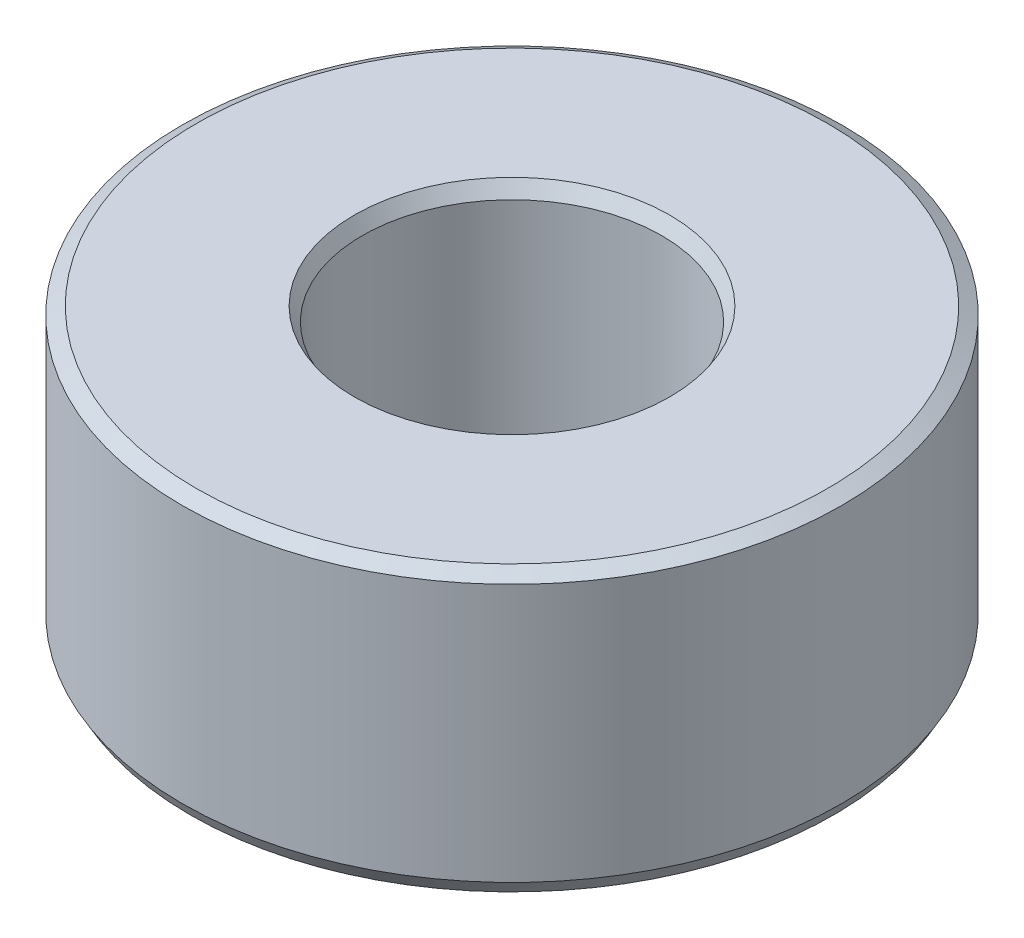
ISO-10303-21;
HEADER;
FILE_DESCRIPTION(('STEP AP214'),'2;1');
FILE_NAME('part.step','',(''),(''),'','','');
FILE_SCHEMA(('AUTOMOTIVE_DESIGN { 1 0 10303 214 1 1 1 1 }'));
ENDSEC;
DATA;
#1=APPLICATION_CONTEXT('core data for automotive mechanical design processes');
#2=APPLICATION_PROTOCOL_DEFINITION('international standard','automotive_design',2000,#1);
#3=PRODUCT_CONTEXT('',#1,'mechanical');
#4=PRODUCT('Part','Part','',(#3));
#5=PRODUCT_RELATED_PRODUCT_CATEGORY('part','',(#4));
#6=PRODUCT_DEFINITION_FORMATION('','',#4);
#7=PRODUCT_DEFINITION_CONTEXT('part definition',#1,'design');
#8=PRODUCT_DEFINITION('design','',#6,#7);
#9=PRODUCT_DEFINITION_SHAPE('','',#8);
#10=(LENGTH_UNIT() NAMED_UNIT(*) SI_UNIT(.MILLI.,.METRE.));
#11=(NAMED_UNIT(*) PLANE_ANGLE_UNIT() SI_UNIT($,.RADIAN.));
#12=(NAMED_UNIT(*) SI_UNIT($,.STERADIAN.) SOLID_ANGLE_UNIT());
#13=UNCERTAINTY_MEASURE_WITH_UNIT(LENGTH_MEASURE(1.E-05),#10,'distance_accuracy_value','');
#14=(GEOMETRIC_REPRESENTATION_CONTEXT(3) GLOBAL_UNCERTAINTY_ASSIGNED_CONTEXT((#13)) GLOBAL_UNIT_ASSIGNED_CONTEXT((#10,
#11,#12)) REPRESENTATION_CONTEXT('',''));
#15=CARTESIAN_POINT('',(0.,0.,0.));
#16=DIRECTION('',(0.,0.,1.));
#17=DIRECTION('',(1.,0.,0.));
#18=AXIS2_PLACEMENT_3D('',#15,#16,#17);
#19=CARTESIAN_POINT('',(0.,38.2073004879539,0.));
#20=DIRECTION('',(0.,-1.,0.));
#21=DIRECTION('',(0.,0.,-1.));
#22=AXIS2_PLACEMENT_3D('',#19,#20,#21);
#23=CYLINDRICAL_SURFACE('',#22,45.);
#24=CARTESIAN_POINT('',(0.,1.88488755583868,0.));
#25=DIRECTION('',(0.,1.,0.));
#26=DIRECTION('',(0.,0.,1.));
#27=AXIS2_PLACEMENT_3D('',#24,#25,#26);
#28=CIRCLE('',#27,45.);
#29=CARTESIAN_POINT('',(0.,1.88488755583868,45.));
#30=VERTEX_POINT('',#29);
#31=EDGE_CURVE('E10',#30,#30,#28,.T.);
#32=ORIENTED_EDGE('',*,*,#31,.T.);
#33=EDGE_LOOP('',(#32));
#34=FACE_BOUND('',#33,.T.);
#35=CARTESIAN_POINT('',(0.,37.1190601501982,0.));
#36=DIRECTION('',(0.,1.,0.));
#37=DIRECTION('',(0.,0.,1.));
#38=AXIS2_PLACEMENT_3D('',#35,#36,#37);
#39=CIRCLE('',#38,45.);
#40=CARTESIAN_POINT('',(0.,37.1190601501982,45.));
#41=VERTEX_POINT('',#40);
#42=EDGE_CURVE('E50',#41,#41,#39,.F.);
#43=ORIENTED_EDGE('',*,*,#42,.T.);
#44=EDGE_LOOP('',(#43));
#45=FACE_BOUND('',#44,.T.);
#46=ADVANCED_FACE('F39',(#34,#45),#23,.T.);
#47=CARTESIAN_POINT('',(0.,38.2073004879539,0.));
#48=DIRECTION('',(0.,1.,0.));
#49=DIRECTION('',(0.,0.,1.));
#50=AXIS2_PLACEMENT_3D('',#47,#48,#49);
#51=PLANE('',#50);
#52=CARTESIAN_POINT('',(0.,38.2073004879539,0.));
#53=DIRECTION('',(0.,1.,0.));
#54=DIRECTION('',(0.,0.,1.));
#55=AXIS2_PLACEMENT_3D('',#52,#53,#54);
#56=CIRCLE('',#55,21.5163535411498);
#57=CARTESIAN_POINT('',(0.,38.2073004879539,21.5163535411498));
#58=VERTEX_POINT('',#57);
#59=EDGE_CURVE('E58',#58,#58,#56,.F.);
#60=ORIENTED_EDGE('',*,*,#59,.T.);
#61=EDGE_LOOP('',(#60));
#62=FACE_BOUND('',#61,.T.);
#63=CARTESIAN_POINT('',(0.,38.2073004879539,0.));
#64=DIRECTION('',(0.,1.,0.));
#65=DIRECTION('',(0.,0.,1.));
#66=AXIS2_PLACEMENT_3D('',#63,#64,#65);
#67=CIRCLE('',#66,43.1151124441613);
#68=CARTESIAN_POINT('',(0.,38.2073004879539,43.1151124441613));
#69=VERTEX_POINT('',#68);
#70=EDGE_CURVE('E61',#69,#69,#67,.T.);
#71=ORIENTED_EDGE('',*,*,#70,.T.);
#72=EDGE_LOOP('',(#71));
#73=FACE_BOUND('',#72,.T.);
#74=ADVANCED_FACE('F88',(#62,#73),#51,.T.);
#75=CARTESIAN_POINT('',(0.,0.,0.));
#76=DIRECTION('',(0.,1.,0.));
#77=DIRECTION('',(0.,0.,1.));
#78=AXIS2_PLACEMENT_3D('',#75,#76,#77);
#79=PLANE('',#78);
#80=CARTESIAN_POINT('',(0.,0.,0.));
#81=DIRECTION('',(0.,1.,0.));
#82=DIRECTION('',(0.,0.,1.));
#83=AXIS2_PLACEMENT_3D('',#80,#81,#82);
#84=CIRCLE('',#83,22.3130007592328);
#85=CARTESIAN_POINT('',(0.,0.,22.3130007592328));
#86=VERTEX_POINT('',#85);
#87=EDGE_CURVE('E51',#86,#86,#84,.T.);
#88=ORIENTED_EDGE('',*,*,#87,.T.);
#89=EDGE_LOOP('',(#88));
#90=FACE_BOUND('',#89,.T.);
#91=CARTESIAN_POINT('',(0.,0.,0.));
#92=DIRECTION('',(0.,1.,0.));
#93=DIRECTION('',(0.,0.,1.));
#94=AXIS2_PLACEMENT_3D('',#91,#92,#93);
#95=CIRCLE('',#94,43.9117596622444);
#96=CARTESIAN_POINT('',(0.,0.,43.9117596622444));
#97=VERTEX_POINT('',#96);
#98=EDGE_CURVE('E54',#97,#97,#95,.F.);
#99=ORIENTED_EDGE('',*,*,#98,.T.);
#100=EDGE_LOOP('',(#99));
#101=FACE_BOUND('',#100,.T.);
#102=ADVANCED_FACE('F83',(#90,#101),#79,.F.);
#103=CARTESIAN_POINT('',(0.,38.2073004879539,0.));
#104=DIRECTION('',(0.,-1.,0.));
#105=DIRECTION('',(0.,0.,-1.));
#106=AXIS2_PLACEMENT_3D('',#103,#104,#105);
#107=CYLINDRICAL_SURFACE('',#106,20.4281132033941);
#108=CARTESIAN_POINT('',(0.,36.3224129321153,0.));
#109=DIRECTION('',(0.,1.,0.));
#110=DIRECTION('',(0.,0.,1.));
#111=AXIS2_PLACEMENT_3D('',#108,#109,#110);
#112=CIRCLE('',#111,20.4281132033941);
#113=CARTESIAN_POINT('',(0.,36.3224129321153,20.4281132033941));
#114=VERTEX_POINT('',#113);
#115=EDGE_CURVE('E67',#114,#114,#112,.T.);
#116=ORIENTED_EDGE('',*,*,#115,.T.);
#117=EDGE_LOOP('',(#116));
#118=FACE_BOUND('',#117,.T.);
#119=CARTESIAN_POINT('',(0.,1.08824033775565,0.));
#120=DIRECTION('',(0.,1.,0.));
#121=DIRECTION('',(0.,0.,1.));
#122=AXIS2_PLACEMENT_3D('',#119,#120,#121);
#123=CIRCLE('',#122,20.4281132033941);
#124=CARTESIAN_POINT('',(0.,1.08824033775565,20.4281132033941));
#125=VERTEX_POINT('',#124);
#126=EDGE_CURVE('E69',#125,#125,#123,.F.);
#127=ORIENTED_EDGE('',*,*,#126,.T.);
#128=EDGE_LOOP('',(#127));
#129=FACE_BOUND('',#128,.T.);
#130=ADVANCED_FACE('F71',(#118,#129),#107,.F.);
#131=CARTESIAN_POINT('',(0.,36.3224129321153,0.));
#132=DIRECTION('',(0.,1.,0.));
#133=DIRECTION('',(0.,0.,1.));
#134=AXIS2_PLACEMENT_3D('',#131,#132,#133);
#135=CONICAL_SURFACE('',#134,20.4281132033941,0.523598775598308);
#136=ORIENTED_EDGE('',*,*,#59,.F.);
#137=EDGE_LOOP('',(#136));
#138=FACE_BOUND('',#137,.T.);
#139=ORIENTED_EDGE('',*,*,#115,.F.);
#140=EDGE_LOOP('',(#139));
#141=FACE_BOUND('',#140,.T.);
#142=ADVANCED_FACE('F77',(#138,#141),#135,.F.);
#143=CARTESIAN_POINT('',(0.,0.,0.));
#144=DIRECTION('',(0.,-1.,0.));
#145=DIRECTION('',(0.,0.,-1.));
#146=AXIS2_PLACEMENT_3D('',#143,#144,#145);
#147=CONICAL_SURFACE('',#146,22.3130007592328,1.0471975511966);
#148=ORIENTED_EDGE('',*,*,#126,.F.);
#149=EDGE_LOOP('',(#148));
#150=FACE_BOUND('',#149,.T.);
#151=ORIENTED_EDGE('',*,*,#87,.F.);
#152=EDGE_LOOP('',(#151));
#153=FACE_BOUND('',#152,.T.);
#154=ADVANCED_FACE('F73',(#150,#153),#147,.F.);
#155=CARTESIAN_POINT('',(0.,1.88488755583868,0.));
#156=DIRECTION('',(0.,1.,0.));
#157=DIRECTION('',(0.,0.,1.));
#158=AXIS2_PLACEMENT_3D('',#155,#156,#157);
#159=CONICAL_SURFACE('',#158,45.,0.523598775598302);
#160=ORIENTED_EDGE('',*,*,#98,.F.);
#161=EDGE_LOOP('',(#160));
#162=FACE_BOUND('',#161,.T.);
#163=ORIENTED_EDGE('',*,*,#31,.F.);
#164=EDGE_LOOP('',(#163));
#165=FACE_BOUND('',#164,.T.);
#166=ADVANCED_FACE('F76',(#162,#165),#159,.T.);
#167=CARTESIAN_POINT('',(0.,38.2073004879539,0.));
#168=DIRECTION('',(0.,-1.,0.));
#169=DIRECTION('',(0.,0.,-1.));
#170=AXIS2_PLACEMENT_3D('',#167,#168,#169);
#171=CONICAL_SURFACE('',#170,43.1151124441613,1.04719755119659);
#172=ORIENTED_EDGE('',*,*,#42,.F.);
#173=EDGE_LOOP('',(#172));
#174=FACE_BOUND('',#173,.T.);
#175=ORIENTED_EDGE('',*,*,#70,.F.);
#176=EDGE_LOOP('',(#175));
#177=FACE_BOUND('',#176,.T.);
#178=ADVANCED_FACE('F45',(#174,#177),#171,.T.);
#179=CLOSED_SHELL('',(#46,#74,#102,#130,#142,#154,#166,#178));
#180=MANIFOLD_SOLID_BREP('B2',#179);
#181=ADVANCED_BREP_SHAPE_REPRESENTATION('',(#18,#180),#14);
#182=SHAPE_DEFINITION_REPRESENTATION(#9,#181);
ENDSEC;
END-ISO-10303-21;
